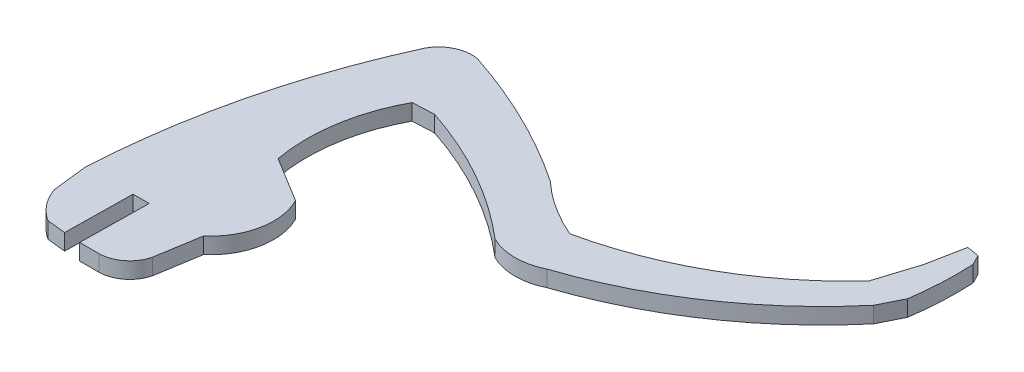
ISO-10303-21;
HEADER;
FILE_DESCRIPTION(('STEP AP214'),'2;1');
FILE_NAME('part.step','',(''),(''),'','','');
FILE_SCHEMA(('AUTOMOTIVE_DESIGN { 1 0 10303 214 1 1 1 1 }'));
ENDSEC;
DATA;
#1=APPLICATION_CONTEXT('core data for automotive mechanical design processes');
#2=APPLICATION_PROTOCOL_DEFINITION('international standard','automotive_design',2000,#1);
#3=PRODUCT_CONTEXT('',#1,'mechanical');
#4=PRODUCT('Part','Part','',(#3));
#5=PRODUCT_RELATED_PRODUCT_CATEGORY('part','',(#4));
#6=PRODUCT_DEFINITION_FORMATION('','',#4);
#7=PRODUCT_DEFINITION_CONTEXT('part definition',#1,'design');
#8=PRODUCT_DEFINITION('design','',#6,#7);
#9=PRODUCT_DEFINITION_SHAPE('','',#8);
#10=(LENGTH_UNIT() NAMED_UNIT(*) SI_UNIT(.MILLI.,.METRE.));
#11=(NAMED_UNIT(*) PLANE_ANGLE_UNIT() SI_UNIT($,.RADIAN.));
#12=(NAMED_UNIT(*) SI_UNIT($,.STERADIAN.) SOLID_ANGLE_UNIT());
#13=UNCERTAINTY_MEASURE_WITH_UNIT(LENGTH_MEASURE(1.E-05),#10,'distance_accuracy_value','');
#14=(GEOMETRIC_REPRESENTATION_CONTEXT(3) GLOBAL_UNCERTAINTY_ASSIGNED_CONTEXT((#13)) GLOBAL_UNIT_ASSIGNED_CONTEXT((#10,
#11,#12)) REPRESENTATION_CONTEXT('',''));
#15=CARTESIAN_POINT('',(0.,0.,0.));
#16=DIRECTION('',(0.,0.,1.));
#17=DIRECTION('',(1.,0.,0.));
#18=AXIS2_PLACEMENT_3D('',#15,#16,#17);
#19=CARTESIAN_POINT('',(-82.7531300000066,2.,-696.223030000004));
#20=DIRECTION('',(-0.0475400172128746,0.,-0.998869334179101));
#21=DIRECTION('',(-0.998869334179101,0.,0.0475400172128746));
#22=AXIS2_PLACEMENT_3D('',#19,#20,#21);
#23=PLANE('',#22);
#24=DIRECTION('',(0.9988693341791,0.,-0.0475400172128746));
#25=VECTOR('',#24,1.);
#26=CARTESIAN_POINT('',(-82.7531300000066,0.,-696.223030000004));
#27=LINE('',#26,#25);
#28=CARTESIAN_POINT('',(-82.7531300000066,0.,-696.223030000004));
#29=VERTEX_POINT('',#28);
#30=CARTESIAN_POINT('',(-80.0906000000355,0.,-696.349750000006));
#31=VERTEX_POINT('',#30);
#32=EDGE_CURVE('E11',#29,#31,#27,.T.);
#33=ORIENTED_EDGE('',*,*,#32,.T.);
#34=DIRECTION('',(0.,-1.,0.));
#35=VECTOR('',#34,1.);
#36=CARTESIAN_POINT('',(-80.0906000000355,2.,-696.349750000006));
#37=LINE('',#36,#35);
#38=CARTESIAN_POINT('',(-80.0906000000355,2.,-696.349750000006));
#39=VERTEX_POINT('',#38);
#40=EDGE_CURVE('E56',#39,#31,#37,.T.);
#41=ORIENTED_EDGE('',*,*,#40,.F.);
#42=DIRECTION('',(0.9988693341791,0.,-0.0475400172128746));
#43=VECTOR('',#42,1.);
#44=CARTESIAN_POINT('',(-82.7531300000066,2.,-696.223030000004));
#45=LINE('',#44,#43);
#46=CARTESIAN_POINT('',(-82.7531300000066,2.,-696.223030000004));
#47=VERTEX_POINT('',#46);
#48=EDGE_CURVE('E41',#47,#39,#45,.T.);
#49=ORIENTED_EDGE('',*,*,#48,.F.);
#50=DIRECTION('',(0.,-1.,0.));
#51=VECTOR('',#50,1.);
#52=CARTESIAN_POINT('',(-82.7531300000066,2.,-696.223030000004));
#53=LINE('',#52,#51);
#54=EDGE_CURVE('E150',#47,#29,#53,.T.);
#55=ORIENTED_EDGE('',*,*,#54,.T.);
#56=EDGE_LOOP('',(#33,#41,#49,#55));
#57=FACE_BOUND('',#56,.T.);
#58=ADVANCED_FACE('F37',(#57),#23,.F.);
#59=CARTESIAN_POINT('',(-96.0068061984431,2.,-648.030262235283));
#60=DIRECTION('',(0.,-1.,0.));
#61=DIRECTION('',(0.,0.,-1.));
#62=AXIS2_PLACEMENT_3D('',#59,#60,#61);
#63=CYLINDRICAL_SURFACE('',#62,50.873357640276);
#64=CARTESIAN_POINT('',(-96.0068061984431,0.,-648.030262235283));
#65=DIRECTION('',(0.,1.,0.));
#66=DIRECTION('',(0.,0.,1.));
#67=AXIS2_PLACEMENT_3D('',#64,#65,#66);
#68=CIRCLE('',#67,50.873357640276);
#69=CARTESIAN_POINT('',(-62.972499999984,0.,-686.719189999979));
#70=VERTEX_POINT('',#69);
#71=EDGE_CURVE('E47',#70,#31,#68,.T.);
#72=ORIENTED_EDGE('',*,*,#71,.F.);
#73=DIRECTION('',(0.,-1.,0.));
#74=VECTOR('',#73,1.);
#75=CARTESIAN_POINT('',(-62.972499999984,2.,-686.719189999979));
#76=LINE('',#75,#74);
#77=CARTESIAN_POINT('',(-62.972499999984,2.,-686.719189999979));
#78=VERTEX_POINT('',#77);
#79=EDGE_CURVE('E138',#78,#70,#76,.T.);
#80=ORIENTED_EDGE('',*,*,#79,.F.);
#81=CARTESIAN_POINT('',(-96.0068061984431,2.,-648.030262235283));
#82=DIRECTION('',(0.,1.,0.));
#83=DIRECTION('',(0.,0.,1.));
#84=AXIS2_PLACEMENT_3D('',#81,#82,#83);
#85=CIRCLE('',#84,50.873357640276);
#86=EDGE_CURVE('E302',#78,#39,#85,.T.);
#87=ORIENTED_EDGE('',*,*,#86,.T.);
#88=ORIENTED_EDGE('',*,*,#40,.T.);
#89=EDGE_LOOP('',(#72,#80,#87,#88));
#90=FACE_BOUND('',#89,.T.);
#91=ADVANCED_FACE('F533',(#90),#63,.F.);
#92=CARTESIAN_POINT('',(-59.7390700000339,2.,-693.211429999977));
#93=DIRECTION('',(0.,-1.,0.));
#94=DIRECTION('',(0.,0.,-1.));
#95=AXIS2_PLACEMENT_3D('',#92,#93,#94);
#96=CYLINDRICAL_SURFACE('',#95,7.25287872380006);
#97=CARTESIAN_POINT('',(-59.7390700000339,0.,-693.211429999977));
#98=DIRECTION('',(0.,1.,0.));
#99=DIRECTION('',(0.,0.,1.));
#100=AXIS2_PLACEMENT_3D('',#97,#98,#99);
#101=CIRCLE('',#100,7.25287872380006);
#102=CARTESIAN_POINT('',(-56.5056400000682,0.,-686.719189999987));
#103=VERTEX_POINT('',#102);
#104=EDGE_CURVE('E224',#70,#103,#101,.T.);
#105=ORIENTED_EDGE('',*,*,#104,.T.);
#106=DIRECTION('',(0.,-1.,0.));
#107=VECTOR('',#106,1.);
#108=CARTESIAN_POINT('',(-56.5056400000682,2.,-686.719189999987));
#109=LINE('',#108,#107);
#110=CARTESIAN_POINT('',(-56.5056400000682,2.,-686.719189999987));
#111=VERTEX_POINT('',#110);
#112=EDGE_CURVE('E227',#111,#103,#109,.T.);
#113=ORIENTED_EDGE('',*,*,#112,.F.);
#114=CARTESIAN_POINT('',(-59.7390700000339,2.,-693.211429999977));
#115=DIRECTION('',(0.,1.,0.));
#116=DIRECTION('',(0.,0.,1.));
#117=AXIS2_PLACEMENT_3D('',#114,#115,#116);
#118=CIRCLE('',#117,7.25287872380006);
#119=EDGE_CURVE('E301',#78,#111,#118,.T.);
#120=ORIENTED_EDGE('',*,*,#119,.F.);
#121=ORIENTED_EDGE('',*,*,#79,.T.);
#122=EDGE_LOOP('',(#105,#113,#120,#121));
#123=FACE_BOUND('',#122,.T.);
#124=ADVANCED_FACE('F226',(#123),#96,.T.);
#125=CARTESIAN_POINT('',(-73.6546728963077,2.,-737.921574819925));
#126=DIRECTION('',(0.,-1.,0.));
#127=DIRECTION('',(0.,0.,-1.));
#128=AXIS2_PLACEMENT_3D('',#125,#126,#127);
#129=CYLINDRICAL_SURFACE('',#128,53.9979031122999);
#130=CARTESIAN_POINT('',(-73.6546728963077,0.,-737.921574819925));
#131=DIRECTION('',(0.,1.,0.));
#132=DIRECTION('',(0.,0.,1.));
#133=AXIS2_PLACEMENT_3D('',#130,#131,#132);
#134=CIRCLE('',#133,53.9979031122999);
#135=CARTESIAN_POINT('',(-32.4132100000863,0.,-703.065939999929));
#136=VERTEX_POINT('',#135);
#137=EDGE_CURVE('E232',#103,#136,#134,.T.);
#138=ORIENTED_EDGE('',*,*,#137,.T.);
#139=DIRECTION('',(0.,-1.,0.));
#140=VECTOR('',#139,1.);
#141=CARTESIAN_POINT('',(-32.4132100000863,2.,-703.065939999929));
#142=LINE('',#141,#140);
#143=CARTESIAN_POINT('',(-32.4132100000863,2.,-703.065939999929));
#144=VERTEX_POINT('',#143);
#145=EDGE_CURVE('E239',#144,#136,#142,.T.);
#146=ORIENTED_EDGE('',*,*,#145,.F.);
#147=CARTESIAN_POINT('',(-73.6546728963077,2.,-737.921574819925));
#148=DIRECTION('',(0.,1.,0.));
#149=DIRECTION('',(0.,0.,1.));
#150=AXIS2_PLACEMENT_3D('',#147,#148,#149);
#151=CIRCLE('',#150,53.9979031122999);
#152=EDGE_CURVE('E238',#111,#144,#151,.T.);
#153=ORIENTED_EDGE('',*,*,#152,.F.);
#154=ORIENTED_EDGE('',*,*,#112,.T.);
#155=EDGE_LOOP('',(#138,#146,#153,#154));
#156=FACE_BOUND('',#155,.T.);
#157=ADVANCED_FACE('F235',(#156),#129,.T.);
#158=CARTESIAN_POINT('',(-32.4132100000863,2.,-703.065939999929));
#159=DIRECTION('',(-0.894280215983275,0.,-0.447507424855618));
#160=DIRECTION('',(-0.447507424855618,0.,0.894280215983275));
#161=AXIS2_PLACEMENT_3D('',#158,#159,#160);
#162=PLANE('',#161);
#163=DIRECTION('',(0.447507424855618,0.,-0.894280215983275));
#164=VECTOR('',#163,1.);
#165=CARTESIAN_POINT('',(-32.4132100000863,0.,-703.065939999929));
#166=LINE('',#165,#164);
#167=CARTESIAN_POINT('',(-31.0182400000587,0.,-705.853589999965));
#168=VERTEX_POINT('',#167);
#169=EDGE_CURVE('E244',#136,#168,#166,.T.);
#170=ORIENTED_EDGE('',*,*,#169,.T.);
#171=DIRECTION('',(0.,-1.,0.));
#172=VECTOR('',#171,1.);
#173=CARTESIAN_POINT('',(-31.0182400000587,2.,-705.853589999965));
#174=LINE('',#173,#172);
#175=CARTESIAN_POINT('',(-31.0182400000587,2.,-705.853589999965));
#176=VERTEX_POINT('',#175);
#177=EDGE_CURVE('E363',#176,#168,#174,.T.);
#178=ORIENTED_EDGE('',*,*,#177,.F.);
#179=DIRECTION('',(0.447507424855618,0.,-0.894280215983275));
#180=VECTOR('',#179,1.);
#181=CARTESIAN_POINT('',(-32.4132100000863,2.,-703.065939999929));
#182=LINE('',#181,#180);
#183=EDGE_CURVE('E298',#144,#176,#182,.T.);
#184=ORIENTED_EDGE('',*,*,#183,.F.);
#185=ORIENTED_EDGE('',*,*,#145,.T.);
#186=EDGE_LOOP('',(#170,#178,#184,#185));
#187=FACE_BOUND('',#186,.T.);
#188=ADVANCED_FACE('F519',(#187),#162,.F.);
#189=CARTESIAN_POINT('',(-69.4354700533529,2.,-711.619498918151));
#190=DIRECTION('',(0.,-1.,0.));
#191=DIRECTION('',(0.,0.,-1.));
#192=AXIS2_PLACEMENT_3D('',#189,#190,#191);
#193=CYLINDRICAL_SURFACE('',#192,38.8475130558);
#194=CARTESIAN_POINT('',(-69.4354700533529,0.,-711.619498918151));
#195=DIRECTION('',(0.,1.,0.));
#196=DIRECTION('',(0.,0.,1.));
#197=AXIS2_PLACEMENT_3D('',#194,#195,#196);
#198=CIRCLE('',#197,38.8475130558);
#199=CARTESIAN_POINT('',(-30.6376400000799,0.,-713.583590000023));
#200=VERTEX_POINT('',#199);
#201=EDGE_CURVE('E246',#168,#200,#198,.T.);
#202=ORIENTED_EDGE('',*,*,#201,.T.);
#203=DIRECTION('',(0.,-1.,0.));
#204=VECTOR('',#203,1.);
#205=CARTESIAN_POINT('',(-30.6376400000799,2.,-713.583590000023));
#206=LINE('',#205,#204);
#207=CARTESIAN_POINT('',(-30.6376400000799,2.,-713.583590000023));
#208=VERTEX_POINT('',#207);
#209=EDGE_CURVE('E360',#208,#200,#206,.T.);
#210=ORIENTED_EDGE('',*,*,#209,.F.);
#211=CARTESIAN_POINT('',(-69.4354700533529,2.,-711.619498918151));
#212=DIRECTION('',(0.,1.,0.));
#213=DIRECTION('',(0.,0.,1.));
#214=AXIS2_PLACEMENT_3D('',#211,#212,#213);
#215=CIRCLE('',#214,38.8475130558);
#216=EDGE_CURVE('E296',#176,#208,#215,.T.);
#217=ORIENTED_EDGE('',*,*,#216,.F.);
#218=ORIENTED_EDGE('',*,*,#177,.T.);
#219=EDGE_LOOP('',(#202,#210,#217,#218));
#220=FACE_BOUND('',#219,.T.);
#221=ADVANCED_FACE('F358',(#220),#193,.T.);
#222=CARTESIAN_POINT('',(-30.6376400000799,2.,-713.583590000023));
#223=DIRECTION('',(-0.894230938229358,0.,0.44760588592359));
#224=DIRECTION('',(0.44760588592359,0.,0.894230938229359));
#225=AXIS2_PLACEMENT_3D('',#222,#223,#224);
#226=PLANE('',#225);
#227=DIRECTION('',(-0.44760588592359,0.,-0.894230938229358));
#228=VECTOR('',#227,1.);
#229=CARTESIAN_POINT('',(-30.6376400000799,0.,-713.583590000023));
#230=LINE('',#229,#228);
#231=CARTESIAN_POINT('',(-31.2719700000587,0.,-714.850859999965));
#232=VERTEX_POINT('',#231);
#233=EDGE_CURVE('E353',#200,#232,#230,.T.);
#234=ORIENTED_EDGE('',*,*,#233,.T.);
#235=DIRECTION('',(0.,-1.,0.));
#236=VECTOR('',#235,1.);
#237=CARTESIAN_POINT('',(-31.2719700000587,2.,-714.850859999965));
#238=LINE('',#237,#236);
#239=CARTESIAN_POINT('',(-31.2719700000587,2.,-714.850859999965));
#240=VERTEX_POINT('',#239);
#241=EDGE_CURVE('E369',#240,#232,#238,.T.);
#242=ORIENTED_EDGE('',*,*,#241,.F.);
#243=DIRECTION('',(-0.44760588592359,0.,-0.894230938229358));
#244=VECTOR('',#243,1.);
#245=CARTESIAN_POINT('',(-30.6376400000799,2.,-713.583590000023));
#246=LINE('',#245,#244);
#247=EDGE_CURVE('E294',#208,#240,#246,.T.);
#248=ORIENTED_EDGE('',*,*,#247,.F.);
#249=ORIENTED_EDGE('',*,*,#209,.T.);
#250=EDGE_LOOP('',(#234,#242,#248,#249));
#251=FACE_BOUND('',#250,.T.);
#252=ADVANCED_FACE('F366',(#251),#226,.F.);
#253=CARTESIAN_POINT('',(-31.2719700000587,2.,-714.850859999965));
#254=DIRECTION('',(-0.164343259760923,0.,0.986403210138305));
#255=DIRECTION('',(0.986403210138305,0.,0.164343259760923));
#256=AXIS2_PLACEMENT_3D('',#253,#254,#255);
#257=PLANE('',#256);
#258=DIRECTION('',(-0.986403210138305,0.,-0.164343259760923));
#259=VECTOR('',#258,1.);
#260=CARTESIAN_POINT('',(-31.2719700000587,0.,-714.850859999965));
#261=LINE('',#260,#259);
#262=CARTESIAN_POINT('',(-32.7932600000587,0.,-715.104319999965));
#263=VERTEX_POINT('',#262);
#264=EDGE_CURVE('E351',#232,#263,#261,.T.);
#265=ORIENTED_EDGE('',*,*,#264,.T.);
#266=DIRECTION('',(0.,-1.,0.));
#267=VECTOR('',#266,1.);
#268=CARTESIAN_POINT('',(-32.7932600000587,2.,-715.104319999965));
#269=LINE('',#268,#267);
#270=CARTESIAN_POINT('',(-32.7932600000587,2.,-715.104319999965));
#271=VERTEX_POINT('',#270);
#272=EDGE_CURVE('E379',#271,#263,#269,.T.);
#273=ORIENTED_EDGE('',*,*,#272,.F.);
#274=DIRECTION('',(-0.986403210138305,0.,-0.164343259760923));
#275=VECTOR('',#274,1.);
#276=CARTESIAN_POINT('',(-31.2719700000587,2.,-714.850859999965));
#277=LINE('',#276,#275);
#278=EDGE_CURVE('E292',#240,#271,#277,.T.);
#279=ORIENTED_EDGE('',*,*,#278,.F.);
#280=ORIENTED_EDGE('',*,*,#241,.T.);
#281=EDGE_LOOP('',(#265,#273,#279,#280));
#282=FACE_BOUND('',#281,.T.);
#283=ADVANCED_FACE('F377',(#282),#257,.F.);
#284=CARTESIAN_POINT('',(-32.7932600000587,2.,-715.104319999965));
#285=DIRECTION('',(0.98157353973626,0.,0.191084761531707));
#286=DIRECTION('',(0.191084761531707,0.,-0.98157353973626));
#287=AXIS2_PLACEMENT_3D('',#284,#285,#286);
#288=PLANE('',#287);
#289=DIRECTION('',(-0.191084761531707,0.,0.98157353973626));
#290=VECTOR('',#289,1.);
#291=CARTESIAN_POINT('',(-32.7932600000587,0.,-715.104319999965));
#292=LINE('',#291,#290);
#293=CARTESIAN_POINT('',(-33.6813200000587,0.,-710.542489999965));
#294=VERTEX_POINT('',#293);
#295=EDGE_CURVE('E349',#263,#294,#292,.T.);
#296=ORIENTED_EDGE('',*,*,#295,.T.);
#297=DIRECTION('',(0.,-1.,0.));
#298=VECTOR('',#297,1.);
#299=CARTESIAN_POINT('',(-33.6813200000587,2.,-710.542489999965));
#300=LINE('',#299,#298);
#301=CARTESIAN_POINT('',(-33.6813200000587,2.,-710.542489999965));
#302=VERTEX_POINT('',#301);
#303=EDGE_CURVE('E385',#302,#294,#300,.T.);
#304=ORIENTED_EDGE('',*,*,#303,.F.);
#305=DIRECTION('',(-0.191084761531707,0.,0.98157353973626));
#306=VECTOR('',#305,1.);
#307=CARTESIAN_POINT('',(-32.7932600000587,2.,-715.104319999965));
#308=LINE('',#307,#306);
#309=EDGE_CURVE('E290',#271,#302,#308,.T.);
#310=ORIENTED_EDGE('',*,*,#309,.F.);
#311=ORIENTED_EDGE('',*,*,#272,.T.);
#312=EDGE_LOOP('',(#296,#304,#310,#311));
#313=FACE_BOUND('',#312,.T.);
#314=ADVANCED_FACE('F382',(#313),#288,.F.);
#315=CARTESIAN_POINT('',(-33.6813200000587,2.,-710.542489999965));
#316=DIRECTION('',(0.953187336027235,0.,0.302380393605974));
#317=DIRECTION('',(0.302380393605974,0.,-0.953187336027235));
#318=AXIS2_PLACEMENT_3D('',#315,#316,#317);
#319=PLANE('',#318);
#320=DIRECTION('',(-0.302380393605974,0.,0.953187336027235));
#321=VECTOR('',#320,1.);
#322=CARTESIAN_POINT('',(-33.6813200000587,0.,-710.542489999965));
#323=LINE('',#322,#321);
#324=CARTESIAN_POINT('',(-35.3294800000615,0.,-705.347030000013));
#325=VERTEX_POINT('',#324);
#326=EDGE_CURVE('E346',#294,#325,#323,.T.);
#327=ORIENTED_EDGE('',*,*,#326,.T.);
#328=DIRECTION('',(0.,-1.,0.));
#329=VECTOR('',#328,1.);
#330=CARTESIAN_POINT('',(-35.3294800000615,2.,-705.347030000013));
#331=LINE('',#330,#329);
#332=CARTESIAN_POINT('',(-35.3294800000615,2.,-705.347030000013));
#333=VERTEX_POINT('',#332);
#334=EDGE_CURVE('E387',#333,#325,#331,.T.);
#335=ORIENTED_EDGE('',*,*,#334,.F.);
#336=DIRECTION('',(-0.302380393605974,0.,0.953187336027235));
#337=VECTOR('',#336,1.);
#338=CARTESIAN_POINT('',(-33.6813200000587,2.,-710.542489999965));
#339=LINE('',#338,#337);
#340=EDGE_CURVE('E288',#302,#333,#339,.T.);
#341=ORIENTED_EDGE('',*,*,#340,.F.);
#342=ORIENTED_EDGE('',*,*,#303,.T.);
#343=EDGE_LOOP('',(#327,#335,#341,#342));
#344=FACE_BOUND('',#343,.T.);
#345=ADVANCED_FACE('F515',(#344),#319,.F.);
#346=CARTESIAN_POINT('',(-68.4026369609534,2.,-735.99606603557));
#347=DIRECTION('',(0.,-1.,0.));
#348=DIRECTION('',(0.,0.,-1.));
#349=AXIS2_PLACEMENT_3D('',#346,#347,#348);
#350=CYLINDRICAL_SURFACE('',#349,45.0909871401);
#351=CARTESIAN_POINT('',(-68.4026369609534,0.,-735.99606603557));
#352=DIRECTION('',(0.,1.,0.));
#353=DIRECTION('',(0.,0.,1.));
#354=AXIS2_PLACEMENT_3D('',#351,#352,#353);
#355=CIRCLE('',#354,45.0909871401);
#356=CARTESIAN_POINT('',(-58.9144400000569,0.,-691.914650000013));
#357=VERTEX_POINT('',#356);
#358=EDGE_CURVE('E343',#357,#325,#355,.T.);
#359=ORIENTED_EDGE('',*,*,#358,.F.);
#360=DIRECTION('',(0.,-1.,0.));
#361=VECTOR('',#360,1.);
#362=CARTESIAN_POINT('',(-58.9144400000569,2.,-691.914650000013));
#363=LINE('',#362,#361);
#364=CARTESIAN_POINT('',(-58.9144400000569,2.,-691.914650000013));
#365=VERTEX_POINT('',#364);
#366=EDGE_CURVE('E392',#365,#357,#363,.T.);
#367=ORIENTED_EDGE('',*,*,#366,.F.);
#368=CARTESIAN_POINT('',(-68.4026369609534,2.,-735.99606603557));
#369=DIRECTION('',(0.,1.,0.));
#370=DIRECTION('',(0.,0.,1.));
#371=AXIS2_PLACEMENT_3D('',#368,#369,#370);
#372=CIRCLE('',#371,45.0909871401);
#373=EDGE_CURVE('E285',#365,#333,#372,.T.);
#374=ORIENTED_EDGE('',*,*,#373,.T.);
#375=ORIENTED_EDGE('',*,*,#334,.T.);
#376=EDGE_LOOP('',(#359,#367,#374,#375));
#377=FACE_BOUND('',#376,.T.);
#378=ADVANCED_FACE('F512',(#377),#350,.F.);
#379=CARTESIAN_POINT('',(-49.4435821568587,2.,-714.040471396965));
#380=DIRECTION('',(0.,-1.,0.));
#381=DIRECTION('',(0.,0.,-1.));
#382=AXIS2_PLACEMENT_3D('',#379,#380,#381);
#383=CYLINDRICAL_SURFACE('',#382,24.0675948273998);
#384=CARTESIAN_POINT('',(-49.4435821568587,0.,-714.040471396965));
#385=DIRECTION('',(0.,1.,0.));
#386=DIRECTION('',(0.,0.,1.));
#387=AXIS2_PLACEMENT_3D('',#384,#385,#386);
#388=CIRCLE('',#387,24.0675948273998);
#389=CARTESIAN_POINT('',(-65.7619000000351,0.,-696.349750000002));
#390=VERTEX_POINT('',#389);
#391=EDGE_CURVE('E340',#390,#357,#388,.T.);
#392=ORIENTED_EDGE('',*,*,#391,.F.);
#393=DIRECTION('',(0.,-1.,0.));
#394=VECTOR('',#393,1.);
#395=CARTESIAN_POINT('',(-65.7619000000351,2.,-696.349750000002));
#396=LINE('',#395,#394);
#397=CARTESIAN_POINT('',(-65.7619000000351,2.,-696.349750000002));
#398=VERTEX_POINT('',#397);
#399=EDGE_CURVE('E394',#398,#390,#396,.T.);
#400=ORIENTED_EDGE('',*,*,#399,.F.);
#401=CARTESIAN_POINT('',(-49.4435821568587,2.,-714.040471396965));
#402=DIRECTION('',(0.,1.,0.));
#403=DIRECTION('',(0.,0.,1.));
#404=AXIS2_PLACEMENT_3D('',#401,#402,#403);
#405=CIRCLE('',#404,24.0675948273998);
#406=EDGE_CURVE('E282',#398,#365,#405,.T.);
#407=ORIENTED_EDGE('',*,*,#406,.T.);
#408=ORIENTED_EDGE('',*,*,#366,.T.);
#409=EDGE_LOOP('',(#392,#400,#407,#408));
#410=FACE_BOUND('',#409,.T.);
#411=ADVANCED_FACE('F506',(#410),#383,.F.);
#412=CARTESIAN_POINT('',(-105.814868184351,2.,-636.759019112297));
#413=DIRECTION('',(0.,-1.,0.));
#414=DIRECTION('',(0.,0.,-1.));
#415=AXIS2_PLACEMENT_3D('',#412,#413,#414);
#416=CYLINDRICAL_SURFACE('',#415,71.8003862671);
#417=CARTESIAN_POINT('',(-105.814868184351,0.,-636.759019112297));
#418=DIRECTION('',(0.,1.,0.));
#419=DIRECTION('',(0.,0.,1.));
#420=AXIS2_PLACEMENT_3D('',#417,#418,#419);
#421=CIRCLE('',#420,71.8003862671);
#422=CARTESIAN_POINT('',(-83.387460000024,0.,-704.966839999922));
#423=VERTEX_POINT('',#422);
#424=EDGE_CURVE('E338',#390,#423,#421,.T.);
#425=ORIENTED_EDGE('',*,*,#424,.T.);
#426=DIRECTION('',(0.,-1.,0.));
#427=VECTOR('',#426,1.);
#428=CARTESIAN_POINT('',(-83.387460000024,2.,-704.966839999922));
#429=LINE('',#428,#427);
#430=CARTESIAN_POINT('',(-83.387460000024,2.,-704.966839999922));
#431=VERTEX_POINT('',#430);
#432=EDGE_CURVE('E396',#431,#423,#429,.T.);
#433=ORIENTED_EDGE('',*,*,#432,.F.);
#434=CARTESIAN_POINT('',(-105.814868184351,2.,-636.759019112297));
#435=DIRECTION('',(0.,1.,0.));
#436=DIRECTION('',(0.,0.,1.));
#437=AXIS2_PLACEMENT_3D('',#434,#435,#436);
#438=CIRCLE('',#437,71.8003862671);
#439=EDGE_CURVE('E280',#398,#431,#438,.T.);
#440=ORIENTED_EDGE('',*,*,#439,.F.);
#441=ORIENTED_EDGE('',*,*,#399,.T.);
#442=EDGE_LOOP('',(#425,#433,#440,#441));
#443=FACE_BOUND('',#442,.T.);
#444=ADVANCED_FACE('F611',(#443),#416,.T.);
#445=CARTESIAN_POINT('',(-84.1693028683784,2.,-700.928908607626));
#446=DIRECTION('',(0.,-1.,0.));
#447=DIRECTION('',(0.,0.,-1.));
#448=AXIS2_PLACEMENT_3D('',#445,#446,#447);
#449=CYLINDRICAL_SURFACE('',#448,4.11292696260008);
#450=CARTESIAN_POINT('',(-84.1693028683784,0.,-700.928908607626));
#451=DIRECTION('',(0.,1.,0.));
#452=DIRECTION('',(0.,0.,1.));
#453=AXIS2_PLACEMENT_3D('',#450,#451,#452);
#454=CIRCLE('',#453,4.11292696260008);
#455=CARTESIAN_POINT('',(-87.8255700000379,0.,-702.812489999982));
#456=VERTEX_POINT('',#455);
#457=EDGE_CURVE('E336',#423,#456,#454,.T.);
#458=ORIENTED_EDGE('',*,*,#457,.T.);
#459=DIRECTION('',(0.,-1.,0.));
#460=VECTOR('',#459,1.);
#461=CARTESIAN_POINT('',(-87.8255700000379,2.,-702.812489999982));
#462=LINE('',#461,#460);
#463=CARTESIAN_POINT('',(-87.8255700000379,2.,-702.812489999982));
#464=VERTEX_POINT('',#463);
#465=EDGE_CURVE('E399',#464,#456,#462,.T.);
#466=ORIENTED_EDGE('',*,*,#465,.F.);
#467=CARTESIAN_POINT('',(-84.1693028683784,2.,-700.928908607626));
#468=DIRECTION('',(0.,1.,0.));
#469=DIRECTION('',(0.,0.,1.));
#470=AXIS2_PLACEMENT_3D('',#467,#468,#469);
#471=CIRCLE('',#470,4.11292696260008);
#472=EDGE_CURVE('E278',#431,#464,#471,.T.);
#473=ORIENTED_EDGE('',*,*,#472,.F.);
#474=ORIENTED_EDGE('',*,*,#432,.T.);
#475=EDGE_LOOP('',(#458,#466,#473,#474));
#476=FACE_BOUND('',#475,.T.);
#477=ADVANCED_FACE('F500',(#476),#449,.T.);
#478=CARTESIAN_POINT('',(-3.27849640649838,2.,-664.296184752032));
#479=DIRECTION('',(0.,-1.,0.));
#480=DIRECTION('',(0.,0.,-1.));
#481=AXIS2_PLACEMENT_3D('',#478,#479,#480);
#482=CYLINDRICAL_SURFACE('',#481,92.9070149299);
#483=CARTESIAN_POINT('',(-3.27849640649838,0.,-664.296184752032));
#484=DIRECTION('',(0.,1.,0.));
#485=DIRECTION('',(0.,0.,1.));
#486=AXIS2_PLACEMENT_3D('',#483,#484,#485);
#487=CIRCLE('',#486,92.9070149299);
#488=CARTESIAN_POINT('',(-96.0674499999997,0.,-668.978440000065));
#489=VERTEX_POINT('',#488);
#490=EDGE_CURVE('E334',#456,#489,#487,.T.);
#491=ORIENTED_EDGE('',*,*,#490,.T.);
#492=DIRECTION('',(0.,-1.,0.));
#493=VECTOR('',#492,1.);
#494=CARTESIAN_POINT('',(-96.0674499999997,2.,-668.978440000065));
#495=LINE('',#494,#493);
#496=CARTESIAN_POINT('',(-96.0674499999997,2.,-668.978440000065));
#497=VERTEX_POINT('',#496);
#498=EDGE_CURVE('E402',#497,#489,#495,.T.);
#499=ORIENTED_EDGE('',*,*,#498,.F.);
#500=CARTESIAN_POINT('',(-3.27849640649838,2.,-664.296184752032));
#501=DIRECTION('',(0.,1.,0.));
#502=DIRECTION('',(0.,0.,1.));
#503=AXIS2_PLACEMENT_3D('',#500,#501,#502);
#504=CIRCLE('',#503,92.9070149299);
#505=EDGE_CURVE('E276',#464,#497,#504,.T.);
#506=ORIENTED_EDGE('',*,*,#505,.F.);
#507=ORIENTED_EDGE('',*,*,#465,.T.);
#508=EDGE_LOOP('',(#491,#499,#506,#507));
#509=FACE_BOUND('',#508,.T.);
#510=ADVANCED_FACE('F496',(#509),#482,.T.);
#511=CARTESIAN_POINT('',(-96.0674499999997,2.,-668.978440000065));
#512=DIRECTION('',(0.993149487102338,0.,-0.116850743550747));
#513=DIRECTION('',(-0.116850743550747,0.,-0.993149487102338));
#514=AXIS2_PLACEMENT_3D('',#511,#512,#513);
#515=PLANE('',#514);
#516=DIRECTION('',(0.116850743550747,0.,0.993149487102338));
#517=VECTOR('',#516,1.);
#518=CARTESIAN_POINT('',(-96.0674499999997,0.,-668.978440000065));
#519=LINE('',#518,#517);
#520=CARTESIAN_POINT('',(-95.5605399999999,0.,-664.67006));
#521=VERTEX_POINT('',#520);
#522=EDGE_CURVE('E332',#489,#521,#519,.T.);
#523=ORIENTED_EDGE('',*,*,#522,.T.);
#524=DIRECTION('',(0.,-1.,0.));
#525=VECTOR('',#524,1.);
#526=CARTESIAN_POINT('',(-95.5605399999999,2.,-664.67006));
#527=LINE('',#526,#525);
#528=CARTESIAN_POINT('',(-95.5605399999999,2.,-664.67006));
#529=VERTEX_POINT('',#528);
#530=EDGE_CURVE('E405',#529,#521,#527,.T.);
#531=ORIENTED_EDGE('',*,*,#530,.F.);
#532=DIRECTION('',(0.116850743550747,0.,0.993149487102338));
#533=VECTOR('',#532,1.);
#534=CARTESIAN_POINT('',(-96.0674499999997,2.,-668.978440000065));
#535=LINE('',#534,#533);
#536=EDGE_CURVE('E274',#497,#529,#535,.T.);
#537=ORIENTED_EDGE('',*,*,#536,.F.);
#538=ORIENTED_EDGE('',*,*,#498,.T.);
#539=EDGE_LOOP('',(#523,#531,#537,#538));
#540=FACE_BOUND('',#539,.T.);
#541=ADVANCED_FACE('F491',(#540),#515,.F.);
#542=CARTESIAN_POINT('',(-88.7380788174285,2.,-667.090398510118));
#543=DIRECTION('',(0.,-1.,0.));
#544=DIRECTION('',(0.,0.,-1.));
#545=AXIS2_PLACEMENT_3D('',#542,#543,#544);
#546=CYLINDRICAL_SURFACE('',#545,7.23906175489998);
#547=CARTESIAN_POINT('',(-88.7380788174285,0.,-667.090398510118));
#548=DIRECTION('',(0.,1.,0.));
#549=DIRECTION('',(0.,0.,1.));
#550=AXIS2_PLACEMENT_3D('',#547,#548,#549);
#551=CIRCLE('',#550,7.23906175489998);
#552=CARTESIAN_POINT('',(-92.6437199999873,0.,-660.995320000012));
#553=VERTEX_POINT('',#552);
#554=EDGE_CURVE('E330',#521,#553,#551,.T.);
#555=ORIENTED_EDGE('',*,*,#554,.T.);
#556=DIRECTION('',(0.,-1.,0.));
#557=VECTOR('',#556,1.);
#558=CARTESIAN_POINT('',(-92.6437199999873,2.,-660.995320000012));
#559=LINE('',#558,#557);
#560=CARTESIAN_POINT('',(-92.6437199999873,2.,-660.995320000012));
#561=VERTEX_POINT('',#560);
#562=EDGE_CURVE('E408',#561,#553,#559,.T.);
#563=ORIENTED_EDGE('',*,*,#562,.F.);
#564=CARTESIAN_POINT('',(-88.7380788174285,2.,-667.090398510118));
#565=DIRECTION('',(0.,1.,0.));
#566=DIRECTION('',(0.,0.,1.));
#567=AXIS2_PLACEMENT_3D('',#564,#565,#566);
#568=CIRCLE('',#567,7.23906175489998);
#569=EDGE_CURVE('E272',#529,#561,#568,.T.);
#570=ORIENTED_EDGE('',*,*,#569,.F.);
#571=ORIENTED_EDGE('',*,*,#530,.T.);
#572=EDGE_LOOP('',(#555,#563,#570,#571));
#573=FACE_BOUND('',#572,.T.);
#574=ADVANCED_FACE('F485',(#573),#546,.T.);
#575=CARTESIAN_POINT('',(-92.6437199999873,2.,-660.995320000012));
#576=DIRECTION('',(0.104642260187957,0.,-0.994509928247454));
#577=DIRECTION('',(-0.994509928247454,0.,-0.104642260187957));
#578=AXIS2_PLACEMENT_3D('',#575,#576,#577);
#579=PLANE('',#578);
#580=DIRECTION('',(0.994509928247454,0.,0.104642260187957));
#581=VECTOR('',#580,1.);
#582=CARTESIAN_POINT('',(-92.6437199999873,0.,-660.995320000012));
#583=LINE('',#582,#581);
#584=CARTESIAN_POINT('',(-90.33066,0.,-660.75194));
#585=VERTEX_POINT('',#584);
#586=EDGE_CURVE('E328',#553,#585,#583,.T.);
#587=ORIENTED_EDGE('',*,*,#586,.T.);
#588=DIRECTION('',(0.,-1.,0.));
#589=VECTOR('',#588,1.);
#590=CARTESIAN_POINT('',(-90.33066,2.,-660.75194));
#591=LINE('',#590,#589);
#592=CARTESIAN_POINT('',(-90.33066,2.,-660.75194));
#593=VERTEX_POINT('',#592);
#594=EDGE_CURVE('E411',#593,#585,#591,.T.);
#595=ORIENTED_EDGE('',*,*,#594,.F.);
#596=DIRECTION('',(0.994509928247454,0.,0.104642260187957));
#597=VECTOR('',#596,1.);
#598=CARTESIAN_POINT('',(-92.6437199999873,2.,-660.995320000012));
#599=LINE('',#598,#597);
#600=EDGE_CURVE('E270',#561,#593,#599,.T.);
#601=ORIENTED_EDGE('',*,*,#600,.F.);
#602=ORIENTED_EDGE('',*,*,#562,.T.);
#603=EDGE_LOOP('',(#587,#595,#601,#602));
#604=FACE_BOUND('',#603,.T.);
#605=ADVANCED_FACE('F481',(#604),#579,.F.);
#606=CARTESIAN_POINT('',(-90.33066,2.,-660.75194));
#607=DIRECTION('',(-0.999888376210919,0.,-0.0149410547918164));
#608=DIRECTION('',(-0.0149410547918164,0.,0.999888376210919));
#609=AXIS2_PLACEMENT_3D('',#606,#607,#608);
#610=PLANE('',#609);
#611=DIRECTION('',(0.0149410547918164,0.,-0.999888376210919));
#612=VECTOR('',#611,1.);
#613=CARTESIAN_POINT('',(-90.33066,0.,-660.75194));
#614=LINE('',#613,#612);
#615=CARTESIAN_POINT('',(-90.20584,0.,-669.10517));
#616=VERTEX_POINT('',#615);
#617=EDGE_CURVE('E326',#585,#616,#614,.T.);
#618=ORIENTED_EDGE('',*,*,#617,.T.);
#619=DIRECTION('',(0.,-1.,0.));
#620=VECTOR('',#619,1.);
#621=CARTESIAN_POINT('',(-90.20584,2.,-669.10517));
#622=LINE('',#621,#620);
#623=CARTESIAN_POINT('',(-90.20584,2.,-669.10517));
#624=VERTEX_POINT('',#623);
#625=EDGE_CURVE('E414',#624,#616,#622,.T.);
#626=ORIENTED_EDGE('',*,*,#625,.F.);
#627=DIRECTION('',(0.0149410547918164,0.,-0.999888376210919));
#628=VECTOR('',#627,1.);
#629=CARTESIAN_POINT('',(-90.33066,2.,-660.75194));
#630=LINE('',#629,#628);
#631=EDGE_CURVE('E268',#593,#624,#630,.T.);
#632=ORIENTED_EDGE('',*,*,#631,.F.);
#633=ORIENTED_EDGE('',*,*,#594,.T.);
#634=EDGE_LOOP('',(#618,#626,#632,#633));
#635=FACE_BOUND('',#634,.T.);
#636=ADVANCED_FACE('F476',(#635),#610,.F.);
#637=CARTESIAN_POINT('',(-90.20584,2.,-669.10517));
#638=DIRECTION('',(0.,0.,-1.));
#639=DIRECTION('',(-1.,0.,0.));
#640=AXIS2_PLACEMENT_3D('',#637,#638,#639);
#641=PLANE('',#640);
#642=DIRECTION('',(1.,0.,0.));
#643=VECTOR('',#642,1.);
#644=CARTESIAN_POINT('',(-90.20584,0.,-669.10517));
#645=LINE('',#644,#643);
#646=CARTESIAN_POINT('',(-88.20561,0.,-669.10517));
#647=VERTEX_POINT('',#646);
#648=EDGE_CURVE('E324',#616,#647,#645,.T.);
#649=ORIENTED_EDGE('',*,*,#648,.T.);
#650=DIRECTION('',(0.,-1.,0.));
#651=VECTOR('',#650,1.);
#652=CARTESIAN_POINT('',(-88.20561,2.,-669.10517));
#653=LINE('',#652,#651);
#654=CARTESIAN_POINT('',(-88.20561,2.,-669.10517));
#655=VERTEX_POINT('',#654);
#656=EDGE_CURVE('E417',#655,#647,#653,.T.);
#657=ORIENTED_EDGE('',*,*,#656,.F.);
#658=DIRECTION('',(1.,0.,0.));
#659=VECTOR('',#658,1.);
#660=CARTESIAN_POINT('',(-90.20584,2.,-669.10517));
#661=LINE('',#660,#659);
#662=EDGE_CURVE('E266',#624,#655,#661,.T.);
#663=ORIENTED_EDGE('',*,*,#662,.F.);
#664=ORIENTED_EDGE('',*,*,#625,.T.);
#665=EDGE_LOOP('',(#649,#657,#663,#664));
#666=FACE_BOUND('',#665,.T.);
#667=ADVANCED_FACE('F470',(#666),#641,.F.);
#668=CARTESIAN_POINT('',(-88.20561,2.,-669.10517));
#669=DIRECTION('',(0.999888365943409,0.,0.0149417419004709));
#670=DIRECTION('',(0.0149417419004709,0.,-0.999888365943409));
#671=AXIS2_PLACEMENT_3D('',#668,#669,#670);
#672=PLANE('',#671);
#673=DIRECTION('',(-0.0149417419004709,0.,0.999888365943409));
#674=VECTOR('',#673,1.);
#675=CARTESIAN_POINT('',(-88.20561,0.,-669.10517));
#676=LINE('',#675,#674);
#677=CARTESIAN_POINT('',(-88.33248,0.,-660.61514));
#678=VERTEX_POINT('',#677);
#679=EDGE_CURVE('E322',#647,#678,#676,.T.);
#680=ORIENTED_EDGE('',*,*,#679,.T.);
#681=DIRECTION('',(0.,-1.,0.));
#682=VECTOR('',#681,1.);
#683=CARTESIAN_POINT('',(-88.33248,2.,-660.61514));
#684=LINE('',#683,#682);
#685=CARTESIAN_POINT('',(-88.33248,2.,-660.61514));
#686=VERTEX_POINT('',#685);
#687=EDGE_CURVE('E420',#686,#678,#684,.T.);
#688=ORIENTED_EDGE('',*,*,#687,.F.);
#689=DIRECTION('',(-0.0149417419004709,0.,0.999888365943409));
#690=VECTOR('',#689,1.);
#691=CARTESIAN_POINT('',(-88.20561,2.,-669.10517));
#692=LINE('',#691,#690);
#693=EDGE_CURVE('E264',#655,#686,#692,.T.);
#694=ORIENTED_EDGE('',*,*,#693,.F.);
#695=ORIENTED_EDGE('',*,*,#656,.T.);
#696=EDGE_LOOP('',(#680,#688,#694,#695));
#697=FACE_BOUND('',#696,.T.);
#698=ADVANCED_FACE('F466',(#697),#672,.F.);
#699=CARTESIAN_POINT('',(-88.33248,2.,-660.61514));
#700=DIRECTION('',(0.,0.,-1.));
#701=DIRECTION('',(-1.,0.,0.));
#702=AXIS2_PLACEMENT_3D('',#699,#700,#701);
#703=PLANE('',#702);
#704=DIRECTION('',(1.,0.,0.));
#705=VECTOR('',#704,1.);
#706=CARTESIAN_POINT('',(-88.33248,0.,-660.61514));
#707=LINE('',#706,#705);
#708=CARTESIAN_POINT('',(-85.92368,0.,-660.61514));
#709=VERTEX_POINT('',#708);
#710=EDGE_CURVE('E320',#678,#709,#707,.T.);
#711=ORIENTED_EDGE('',*,*,#710,.T.);
#712=DIRECTION('',(0.,-1.,0.));
#713=VECTOR('',#712,1.);
#714=CARTESIAN_POINT('',(-85.92368,2.,-660.61514));
#715=LINE('',#714,#713);
#716=CARTESIAN_POINT('',(-85.92368,2.,-660.61514));
#717=VERTEX_POINT('',#716);
#718=EDGE_CURVE('E423',#717,#709,#715,.T.);
#719=ORIENTED_EDGE('',*,*,#718,.F.);
#720=DIRECTION('',(1.,0.,0.));
#721=VECTOR('',#720,1.);
#722=CARTESIAN_POINT('',(-88.33248,2.,-660.61514));
#723=LINE('',#722,#721);
#724=EDGE_CURVE('E262',#686,#717,#723,.T.);
#725=ORIENTED_EDGE('',*,*,#724,.F.);
#726=ORIENTED_EDGE('',*,*,#687,.T.);
#727=EDGE_LOOP('',(#711,#719,#725,#726));
#728=FACE_BOUND('',#727,.T.);
#729=ADVANCED_FACE('F461',(#728),#703,.F.);
#730=CARTESIAN_POINT('',(-86.0027012688109,2.,-664.492098994358));
#731=DIRECTION('',(0.,-1.,0.));
#732=DIRECTION('',(0.,0.,-1.));
#733=AXIS2_PLACEMENT_3D('',#730,#731,#732);
#734=CYLINDRICAL_SURFACE('',#733,3.87776422760002);
#735=CARTESIAN_POINT('',(-86.0027012688109,0.,-664.492098994358));
#736=DIRECTION('',(0.,1.,0.));
#737=DIRECTION('',(0.,0.,1.));
#738=AXIS2_PLACEMENT_3D('',#735,#736,#737);
#739=CIRCLE('',#738,3.87776422760002);
#740=CARTESIAN_POINT('',(-82.2462200000373,0.,-663.529860000028));
#741=VERTEX_POINT('',#740);
#742=EDGE_CURVE('E318',#709,#741,#739,.T.);
#743=ORIENTED_EDGE('',*,*,#742,.T.);
#744=DIRECTION('',(0.,-1.,0.));
#745=VECTOR('',#744,1.);
#746=CARTESIAN_POINT('',(-82.2462200000373,2.,-663.529860000028));
#747=LINE('',#746,#745);
#748=CARTESIAN_POINT('',(-82.2462200000373,2.,-663.529860000028));
#749=VERTEX_POINT('',#748);
#750=EDGE_CURVE('E426',#749,#741,#747,.T.);
#751=ORIENTED_EDGE('',*,*,#750,.F.);
#752=CARTESIAN_POINT('',(-86.0027012688109,2.,-664.492098994358));
#753=DIRECTION('',(0.,1.,0.));
#754=DIRECTION('',(0.,0.,1.));
#755=AXIS2_PLACEMENT_3D('',#752,#753,#754);
#756=CIRCLE('',#755,3.87776422760002);
#757=EDGE_CURVE('E260',#717,#749,#756,.T.);
#758=ORIENTED_EDGE('',*,*,#757,.F.);
#759=ORIENTED_EDGE('',*,*,#718,.T.);
#760=EDGE_LOOP('',(#743,#751,#758,#759));
#761=FACE_BOUND('',#760,.T.);
#762=ADVANCED_FACE('F455',(#761),#734,.T.);
#763=CARTESIAN_POINT('',(-82.2462200000373,2.,-663.529860000028));
#764=DIRECTION('',(-0.986991986348496,0.,-0.160769458803127));
#765=DIRECTION('',(-0.160769458803127,0.,0.986991986348496));
#766=AXIS2_PLACEMENT_3D('',#763,#764,#765);
#767=PLANE('',#766);
#768=DIRECTION('',(0.160769458803127,0.,-0.986991986348496));
#769=VECTOR('',#768,1.);
#770=CARTESIAN_POINT('',(-82.2462200000373,0.,-663.529860000028));
#771=LINE('',#770,#769);
#772=CARTESIAN_POINT('',(-81.35871,0.,-668.97844));
#773=VERTEX_POINT('',#772);
#774=EDGE_CURVE('E316',#741,#773,#771,.T.);
#775=ORIENTED_EDGE('',*,*,#774,.T.);
#776=DIRECTION('',(0.,-1.,0.));
#777=VECTOR('',#776,1.);
#778=CARTESIAN_POINT('',(-81.35871,2.,-668.97844));
#779=LINE('',#778,#777);
#780=CARTESIAN_POINT('',(-81.35871,2.,-668.97844));
#781=VERTEX_POINT('',#780);
#782=EDGE_CURVE('E429',#781,#773,#779,.T.);
#783=ORIENTED_EDGE('',*,*,#782,.F.);
#784=DIRECTION('',(0.160769458803127,0.,-0.986991986348496));
#785=VECTOR('',#784,1.);
#786=CARTESIAN_POINT('',(-82.2462200000373,2.,-663.529860000028));
#787=LINE('',#786,#785);
#788=EDGE_CURVE('E258',#749,#781,#787,.T.);
#789=ORIENTED_EDGE('',*,*,#788,.F.);
#790=ORIENTED_EDGE('',*,*,#750,.T.);
#791=EDGE_LOOP('',(#775,#783,#789,#790));
#792=FACE_BOUND('',#791,.T.);
#793=ADVANCED_FACE('F451',(#792),#767,.F.);
#794=CARTESIAN_POINT('',(-86.4424295698059,2.,-674.938132149712));
#795=DIRECTION('',(0.,-1.,0.));
#796=DIRECTION('',(0.,0.,-1.));
#797=AXIS2_PLACEMENT_3D('',#794,#795,#796);
#798=CYLINDRICAL_SURFACE('',#797,7.83339869939999);
#799=CARTESIAN_POINT('',(-86.4424295698059,0.,-674.938132149712));
#800=DIRECTION('',(0.,1.,0.));
#801=DIRECTION('',(0.,0.,1.));
#802=AXIS2_PLACEMENT_3D('',#799,#800,#801);
#803=CIRCLE('',#802,7.83339869939999);
#804=CARTESIAN_POINT('',(-79.4568199999447,0.,-678.482620000054));
#805=VERTEX_POINT('',#804);
#806=EDGE_CURVE('E310',#773,#805,#803,.T.);
#807=ORIENTED_EDGE('',*,*,#806,.T.);
#808=DIRECTION('',(0.,-1.,0.));
#809=VECTOR('',#808,1.);
#810=CARTESIAN_POINT('',(-79.4568199999447,2.,-678.482620000054));
#811=LINE('',#810,#809);
#812=CARTESIAN_POINT('',(-79.4568199999447,2.,-678.482620000054));
#813=VERTEX_POINT('',#812);
#814=EDGE_CURVE('E432',#813,#805,#811,.T.);
#815=ORIENTED_EDGE('',*,*,#814,.F.);
#816=CARTESIAN_POINT('',(-86.4424295698059,2.,-674.938132149712));
#817=DIRECTION('',(0.,1.,0.));
#818=DIRECTION('',(0.,0.,1.));
#819=AXIS2_PLACEMENT_3D('',#816,#817,#818);
#820=CIRCLE('',#819,7.83339869939999);
#821=EDGE_CURVE('E256',#781,#813,#820,.T.);
#822=ORIENTED_EDGE('',*,*,#821,.F.);
#823=ORIENTED_EDGE('',*,*,#782,.T.);
#824=EDGE_LOOP('',(#807,#815,#822,#823));
#825=FACE_BOUND('',#824,.T.);
#826=ADVANCED_FACE('F446',(#825),#798,.T.);
#827=CARTESIAN_POINT('',(-79.4568199999447,2.,-678.482620000054));
#828=DIRECTION('',(-0.522787025798222,0.,0.852463328042356));
#829=DIRECTION('',(0.852463328042356,0.,0.522787025798222));
#830=AXIS2_PLACEMENT_3D('',#827,#828,#829);
#831=PLANE('',#830);
#832=DIRECTION('',(-0.852463328042356,0.,-0.522787025798222));
#833=VECTOR('',#832,1.);
#834=CARTESIAN_POINT('',(-79.4568199999447,0.,-678.482620000054));
#835=LINE('',#834,#833);
#836=CARTESIAN_POINT('',(-85.03562,0.,-681.90391));
#837=VERTEX_POINT('',#836);
#838=EDGE_CURVE('E305',#805,#837,#835,.T.);
#839=ORIENTED_EDGE('',*,*,#838,.T.);
#840=DIRECTION('',(0.,-1.,0.));
#841=VECTOR('',#840,1.);
#842=CARTESIAN_POINT('',(-85.03562,2.,-681.90391));
#843=LINE('',#842,#841);
#844=CARTESIAN_POINT('',(-85.03562,2.,-681.90391));
#845=VERTEX_POINT('',#844);
#846=EDGE_CURVE('E434',#845,#837,#843,.T.);
#847=ORIENTED_EDGE('',*,*,#846,.F.);
#848=DIRECTION('',(-0.852463328042356,0.,-0.522787025798222));
#849=VECTOR('',#848,1.);
#850=CARTESIAN_POINT('',(-79.4568199999447,2.,-678.482620000054));
#851=LINE('',#850,#849);
#852=EDGE_CURVE('E254',#813,#845,#851,.T.);
#853=ORIENTED_EDGE('',*,*,#852,.F.);
#854=ORIENTED_EDGE('',*,*,#814,.T.);
#855=EDGE_LOOP('',(#839,#847,#853,#854));
#856=FACE_BOUND('',#855,.T.);
#857=ADVANCED_FACE('F440',(#856),#831,.F.);
#858=CARTESIAN_POINT('',(-63.4609792142188,2.,-685.806354929597));
#859=DIRECTION('',(0.,-1.,0.));
#860=DIRECTION('',(0.,0.,-1.));
#861=AXIS2_PLACEMENT_3D('',#858,#859,#860);
#862=CYLINDRICAL_SURFACE('',#861,21.9247394845191);
#863=CARTESIAN_POINT('',(-63.4609792142188,0.,-685.806354929597));
#864=DIRECTION('',(0.,1.,0.));
#865=DIRECTION('',(0.,0.,1.));
#866=AXIS2_PLACEMENT_3D('',#863,#864,#865);
#867=CIRCLE('',#866,21.9247394845191);
#868=EDGE_CURVE('E303',#29,#837,#867,.T.);
#869=ORIENTED_EDGE('',*,*,#868,.F.);
#870=ORIENTED_EDGE('',*,*,#54,.F.);
#871=CARTESIAN_POINT('',(-63.4609792142188,2.,-685.806354929597));
#872=DIRECTION('',(0.,1.,0.));
#873=DIRECTION('',(0.,0.,1.));
#874=AXIS2_PLACEMENT_3D('',#871,#872,#873);
#875=CIRCLE('',#874,21.9247394845191);
#876=EDGE_CURVE('E251',#47,#845,#875,.T.);
#877=ORIENTED_EDGE('',*,*,#876,.T.);
#878=ORIENTED_EDGE('',*,*,#846,.T.);
#879=EDGE_LOOP('',(#869,#870,#877,#878));
#880=FACE_BOUND('',#879,.T.);
#881=ADVANCED_FACE('F437',(#880),#862,.F.);
#882=CARTESIAN_POINT('',(-96.0068061984431,2.,-648.030262235283));
#883=DIRECTION('',(0.,1.,0.));
#884=DIRECTION('',(0.,0.,1.));
#885=AXIS2_PLACEMENT_3D('',#882,#883,#884);
#886=PLANE('',#885);
#887=ORIENTED_EDGE('',*,*,#48,.T.);
#888=ORIENTED_EDGE('',*,*,#86,.F.);
#889=ORIENTED_EDGE('',*,*,#119,.T.);
#890=ORIENTED_EDGE('',*,*,#152,.T.);
#891=ORIENTED_EDGE('',*,*,#183,.T.);
#892=ORIENTED_EDGE('',*,*,#216,.T.);
#893=ORIENTED_EDGE('',*,*,#247,.T.);
#894=ORIENTED_EDGE('',*,*,#278,.T.);
#895=ORIENTED_EDGE('',*,*,#309,.T.);
#896=ORIENTED_EDGE('',*,*,#340,.T.);
#897=ORIENTED_EDGE('',*,*,#373,.F.);
#898=ORIENTED_EDGE('',*,*,#406,.F.);
#899=ORIENTED_EDGE('',*,*,#439,.T.);
#900=ORIENTED_EDGE('',*,*,#472,.T.);
#901=ORIENTED_EDGE('',*,*,#505,.T.);
#902=ORIENTED_EDGE('',*,*,#536,.T.);
#903=ORIENTED_EDGE('',*,*,#569,.T.);
#904=ORIENTED_EDGE('',*,*,#600,.T.);
#905=ORIENTED_EDGE('',*,*,#631,.T.);
#906=ORIENTED_EDGE('',*,*,#662,.T.);
#907=ORIENTED_EDGE('',*,*,#693,.T.);
#908=ORIENTED_EDGE('',*,*,#724,.T.);
#909=ORIENTED_EDGE('',*,*,#757,.T.);
#910=ORIENTED_EDGE('',*,*,#788,.T.);
#911=ORIENTED_EDGE('',*,*,#821,.T.);
#912=ORIENTED_EDGE('',*,*,#852,.T.);
#913=ORIENTED_EDGE('',*,*,#876,.F.);
#914=EDGE_LOOP('',(#887,#888,#889,#890,#891,#892,#893,#894,#895,#896,#897,#898,#899,#900,#901,
#902,#903,#904,#905,#906,#907,#908,#909,#910,#911,#912,#913));
#915=FACE_BOUND('',#914,.T.);
#916=ADVANCED_FACE('F39',(#915),#886,.T.);
#917=CARTESIAN_POINT('',(-96.0068061984431,0.,-648.030262235283));
#918=DIRECTION('',(0.,1.,0.));
#919=DIRECTION('',(0.,0.,1.));
#920=AXIS2_PLACEMENT_3D('',#917,#918,#919);
#921=PLANE('',#920);
#922=ORIENTED_EDGE('',*,*,#32,.F.);
#923=ORIENTED_EDGE('',*,*,#868,.T.);
#924=ORIENTED_EDGE('',*,*,#838,.F.);
#925=ORIENTED_EDGE('',*,*,#806,.F.);
#926=ORIENTED_EDGE('',*,*,#774,.F.);
#927=ORIENTED_EDGE('',*,*,#742,.F.);
#928=ORIENTED_EDGE('',*,*,#710,.F.);
#929=ORIENTED_EDGE('',*,*,#679,.F.);
#930=ORIENTED_EDGE('',*,*,#648,.F.);
#931=ORIENTED_EDGE('',*,*,#617,.F.);
#932=ORIENTED_EDGE('',*,*,#586,.F.);
#933=ORIENTED_EDGE('',*,*,#554,.F.);
#934=ORIENTED_EDGE('',*,*,#522,.F.);
#935=ORIENTED_EDGE('',*,*,#490,.F.);
#936=ORIENTED_EDGE('',*,*,#457,.F.);
#937=ORIENTED_EDGE('',*,*,#424,.F.);
#938=ORIENTED_EDGE('',*,*,#391,.T.);
#939=ORIENTED_EDGE('',*,*,#358,.T.);
#940=ORIENTED_EDGE('',*,*,#326,.F.);
#941=ORIENTED_EDGE('',*,*,#295,.F.);
#942=ORIENTED_EDGE('',*,*,#264,.F.);
#943=ORIENTED_EDGE('',*,*,#233,.F.);
#944=ORIENTED_EDGE('',*,*,#201,.F.);
#945=ORIENTED_EDGE('',*,*,#169,.F.);
#946=ORIENTED_EDGE('',*,*,#137,.F.);
#947=ORIENTED_EDGE('',*,*,#104,.F.);
#948=ORIENTED_EDGE('',*,*,#71,.T.);
#949=EDGE_LOOP('',(#922,#923,#924,#925,#926,#927,#928,#929,#930,#931,#932,#933,#934,#935,#936,
#937,#938,#939,#940,#941,#942,#943,#944,#945,#946,#947,#948));
#950=FACE_BOUND('',#949,.T.);
#951=ADVANCED_FACE('F242',(#950),#921,.F.);
#952=CLOSED_SHELL('',(#58,#91,#124,#157,#188,#221,#252,#283,#314,#345,#378,#411,#444,#477,#510,
#541,#574,#605,#636,#667,#698,#729,#762,#793,#826,#857,#881,#916,#951));
#953=MANIFOLD_SOLID_BREP('B2',#952);
#954=ADVANCED_BREP_SHAPE_REPRESENTATION('',(#18,#953),#14);
#955=SHAPE_DEFINITION_REPRESENTATION(#9,#954);
ENDSEC;
END-ISO-10303-21;
